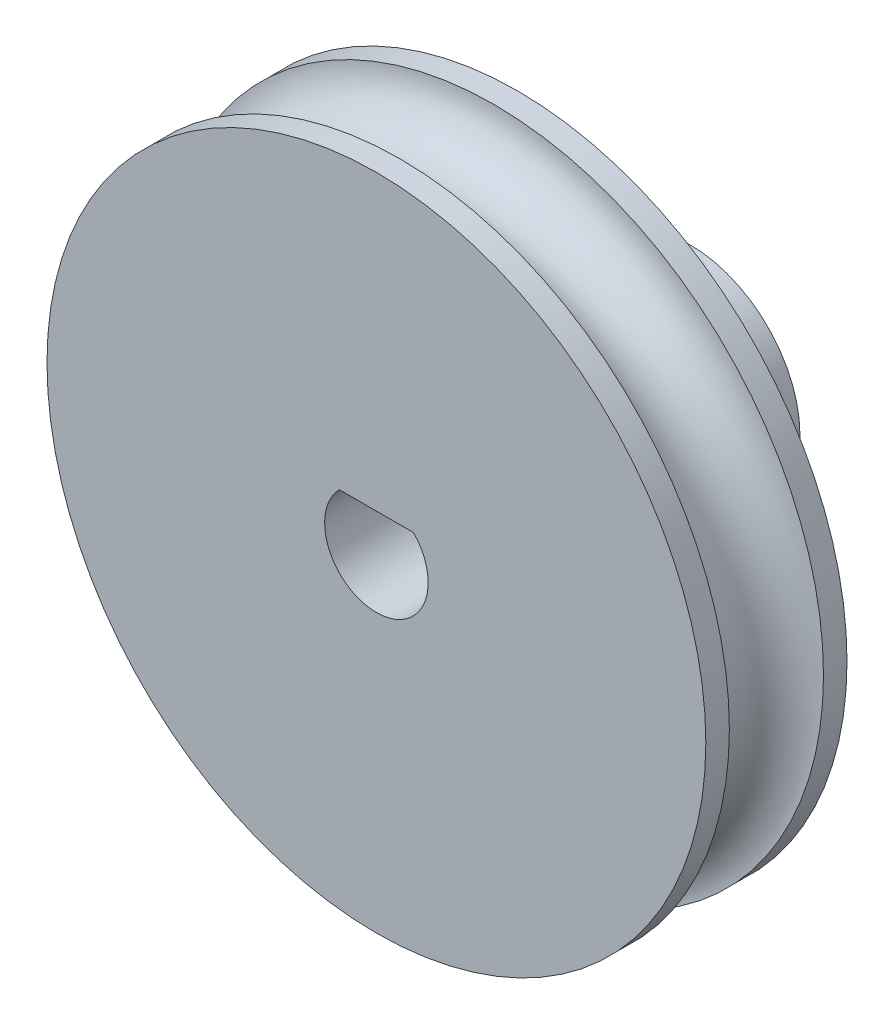
ISO-10303-21;
HEADER;
FILE_DESCRIPTION(('STEP AP214'),'2;1');
FILE_NAME('part.step','',(''),(''),'','','');
FILE_SCHEMA(('AUTOMOTIVE_DESIGN { 1 0 10303 214 1 1 1 1 }'));
ENDSEC;
DATA;
#1=APPLICATION_CONTEXT('core data for automotive mechanical design processes');
#2=APPLICATION_PROTOCOL_DEFINITION('international standard','automotive_design',2000,#1);
#3=PRODUCT_CONTEXT('',#1,'mechanical');
#4=PRODUCT('Part','Part','',(#3));
#5=PRODUCT_RELATED_PRODUCT_CATEGORY('part','',(#4));
#6=PRODUCT_DEFINITION_FORMATION('','',#4);
#7=PRODUCT_DEFINITION_CONTEXT('part definition',#1,'design');
#8=PRODUCT_DEFINITION('design','',#6,#7);
#9=PRODUCT_DEFINITION_SHAPE('','',#8);
#10=(LENGTH_UNIT() NAMED_UNIT(*) SI_UNIT(.MILLI.,.METRE.));
#11=(NAMED_UNIT(*) PLANE_ANGLE_UNIT() SI_UNIT($,.RADIAN.));
#12=(NAMED_UNIT(*) SI_UNIT($,.STERADIAN.) SOLID_ANGLE_UNIT());
#13=UNCERTAINTY_MEASURE_WITH_UNIT(LENGTH_MEASURE(1.E-05),#10,'distance_accuracy_value','');
#14=(GEOMETRIC_REPRESENTATION_CONTEXT(3) GLOBAL_UNCERTAINTY_ASSIGNED_CONTEXT((#13)) GLOBAL_UNIT_ASSIGNED_CONTEXT((#10,
#11,#12)) REPRESENTATION_CONTEXT('',''));
#15=CARTESIAN_POINT('',(0.,0.,0.));
#16=DIRECTION('',(0.,0.,1.));
#17=DIRECTION('',(1.,0.,0.));
#18=AXIS2_PLACEMENT_3D('',#15,#16,#17);
#19=CARTESIAN_POINT('',(0.,3.5,-10.));
#20=DIRECTION('',(0.,0.,1.));
#21=DIRECTION('',(1.,0.,0.));
#22=AXIS2_PLACEMENT_3D('',#19,#20,#21);
#23=PLANE('',#22);
#24=DIRECTION('',(1.,0.,0.));
#25=VECTOR('',#24,1.);
#26=CARTESIAN_POINT('',(1.18321595661992,1.15,-10.));
#27=LINE('',#26,#25);
#28=CARTESIAN_POINT('',(-1.18321595661992,1.15,-10.));
#29=VERTEX_POINT('',#28);
#30=CARTESIAN_POINT('',(1.18321595661992,1.15,-10.));
#31=VERTEX_POINT('',#30);
#32=EDGE_CURVE('E67',#29,#31,#27,.T.);
#33=ORIENTED_EDGE('',*,*,#32,.F.);
#34=CARTESIAN_POINT('',(0.,0.,-10.));
#35=DIRECTION('',(0.,0.,-1.));
#36=DIRECTION('',(-1.,0.,0.));
#37=AXIS2_PLACEMENT_3D('',#34,#35,#36);
#38=CIRCLE('',#37,1.65);
#39=EDGE_CURVE('E48',#31,#29,#38,.T.);
#40=ORIENTED_EDGE('',*,*,#39,.F.);
#41=EDGE_LOOP('',(#33,#40));
#42=FACE_BOUND('',#41,.T.);
#43=CARTESIAN_POINT('',(0.,0.,-10.));
#44=DIRECTION('',(0.,0.,1.));
#45=DIRECTION('',(1.,0.,0.));
#46=AXIS2_PLACEMENT_3D('',#43,#44,#45);
#47=CIRCLE('',#46,3.5);
#48=CARTESIAN_POINT('',(3.5,0.,-10.));
#49=VERTEX_POINT('',#48);
#50=EDGE_CURVE('E11',#49,#49,#47,.T.);
#51=ORIENTED_EDGE('',*,*,#50,.F.);
#52=EDGE_LOOP('',(#51));
#53=FACE_BOUND('',#52,.T.);
#54=ADVANCED_FACE('F34',(#42,#53),#23,.F.);
#55=CARTESIAN_POINT('',(0.,0.,0.));
#56=DIRECTION('',(0.,0.,1.));
#57=DIRECTION('',(1.,0.,0.));
#58=AXIS2_PLACEMENT_3D('',#55,#56,#57);
#59=CYLINDRICAL_SURFACE('',#58,3.5);
#60=CARTESIAN_POINT('',(0.,0.,-4.5));
#61=DIRECTION('',(0.,0.,1.));
#62=DIRECTION('',(1.,0.,0.));
#63=AXIS2_PLACEMENT_3D('',#60,#61,#62);
#64=CIRCLE('',#63,3.5);
#65=CARTESIAN_POINT('',(3.5,0.,-4.5));
#66=VERTEX_POINT('',#65);
#67=EDGE_CURVE('E41',#66,#66,#64,.T.);
#68=ORIENTED_EDGE('',*,*,#67,.F.);
#69=EDGE_LOOP('',(#68));
#70=FACE_BOUND('',#69,.T.);
#71=ORIENTED_EDGE('',*,*,#50,.T.);
#72=EDGE_LOOP('',(#71));
#73=FACE_BOUND('',#72,.T.);
#74=ADVANCED_FACE('F94',(#70,#73),#59,.T.);
#75=CARTESIAN_POINT('',(0.,10.5,-4.5));
#76=DIRECTION('',(0.,0.,1.));
#77=DIRECTION('',(1.,0.,0.));
#78=AXIS2_PLACEMENT_3D('',#75,#76,#77);
#79=PLANE('',#78);
#80=CARTESIAN_POINT('',(0.,0.,-4.5));
#81=DIRECTION('',(0.,0.,1.));
#82=DIRECTION('',(1.,0.,0.));
#83=AXIS2_PLACEMENT_3D('',#80,#81,#82);
#84=CIRCLE('',#83,10.5);
#85=CARTESIAN_POINT('',(10.5,0.,-4.5));
#86=VERTEX_POINT('',#85);
#87=EDGE_CURVE('E87',#86,#86,#84,.T.);
#88=ORIENTED_EDGE('',*,*,#87,.F.);
#89=EDGE_LOOP('',(#88));
#90=FACE_BOUND('',#89,.T.);
#91=ORIENTED_EDGE('',*,*,#67,.T.);
#92=EDGE_LOOP('',(#91));
#93=FACE_BOUND('',#92,.T.);
#94=ADVANCED_FACE('F92',(#90,#93),#79,.F.);
#95=CARTESIAN_POINT('',(0.,0.,0.));
#96=DIRECTION('',(0.,0.,1.));
#97=DIRECTION('',(1.,0.,0.));
#98=AXIS2_PLACEMENT_3D('',#95,#96,#97);
#99=CYLINDRICAL_SURFACE('',#98,10.5);
#100=CARTESIAN_POINT('',(0.,0.,-3.75));
#101=DIRECTION('',(0.,0.,1.));
#102=DIRECTION('',(1.,0.,0.));
#103=AXIS2_PLACEMENT_3D('',#100,#101,#102);
#104=CIRCLE('',#103,10.5);
#105=CARTESIAN_POINT('',(10.5,0.,-3.75));
#106=VERTEX_POINT('',#105);
#107=EDGE_CURVE('E84',#106,#106,#104,.T.);
#108=ORIENTED_EDGE('',*,*,#107,.F.);
#109=EDGE_LOOP('',(#108));
#110=FACE_BOUND('',#109,.T.);
#111=ORIENTED_EDGE('',*,*,#87,.T.);
#112=EDGE_LOOP('',(#111));
#113=FACE_BOUND('',#112,.T.);
#114=ADVANCED_FACE('F141',(#110,#113),#99,.T.);
#115=CARTESIAN_POINT('',(0.,0.,-2.25));
#116=DIRECTION('',(0.,0.,1.));
#117=DIRECTION('',(1.,0.,0.));
#118=AXIS2_PLACEMENT_3D('',#115,#116,#117);
#119=TOROIDAL_SURFACE('',#118,10.5,1.5);
#120=CARTESIAN_POINT('',(0.,0.,-0.75));
#121=DIRECTION('',(0.,0.,1.));
#122=DIRECTION('',(1.,0.,0.));
#123=AXIS2_PLACEMENT_3D('',#120,#121,#122);
#124=CIRCLE('',#123,10.5);
#125=CARTESIAN_POINT('',(10.5,0.,-0.75));
#126=VERTEX_POINT('',#125);
#127=EDGE_CURVE('E81',#126,#126,#124,.T.);
#128=ORIENTED_EDGE('',*,*,#127,.F.);
#129=EDGE_LOOP('',(#128));
#130=FACE_BOUND('',#129,.T.);
#131=ORIENTED_EDGE('',*,*,#107,.T.);
#132=EDGE_LOOP('',(#131));
#133=FACE_BOUND('',#132,.T.);
#134=ADVANCED_FACE('F137',(#130,#133),#119,.F.);
#135=CARTESIAN_POINT('',(0.,0.,0.));
#136=DIRECTION('',(0.,0.,1.));
#137=DIRECTION('',(1.,0.,0.));
#138=AXIS2_PLACEMENT_3D('',#135,#136,#137);
#139=CYLINDRICAL_SURFACE('',#138,10.5);
#140=CARTESIAN_POINT('',(0.,0.,0.));
#141=DIRECTION('',(0.,0.,1.));
#142=DIRECTION('',(1.,0.,0.));
#143=AXIS2_PLACEMENT_3D('',#140,#141,#142);
#144=CIRCLE('',#143,10.5);
#145=CARTESIAN_POINT('',(10.5,0.,0.));
#146=VERTEX_POINT('',#145);
#147=EDGE_CURVE('E78',#146,#146,#144,.T.);
#148=ORIENTED_EDGE('',*,*,#147,.F.);
#149=EDGE_LOOP('',(#148));
#150=FACE_BOUND('',#149,.T.);
#151=ORIENTED_EDGE('',*,*,#127,.T.);
#152=EDGE_LOOP('',(#151));
#153=FACE_BOUND('',#152,.T.);
#154=ADVANCED_FACE('F107',(#150,#153),#139,.T.);
#155=CARTESIAN_POINT('',(0.,0.,0.));
#156=DIRECTION('',(0.,0.,-1.));
#157=DIRECTION('',(-1.,0.,0.));
#158=AXIS2_PLACEMENT_3D('',#155,#156,#157);
#159=PLANE('',#158);
#160=DIRECTION('',(-1.,0.,0.));
#161=VECTOR('',#160,1.);
#162=CARTESIAN_POINT('',(1.18321595661992,1.15,0.));
#163=LINE('',#162,#161);
#164=CARTESIAN_POINT('',(1.18321595661992,1.15,0.));
#165=VERTEX_POINT('',#164);
#166=CARTESIAN_POINT('',(-1.18321595661992,1.15,0.));
#167=VERTEX_POINT('',#166);
#168=EDGE_CURVE('E76',#165,#167,#163,.T.);
#169=ORIENTED_EDGE('',*,*,#168,.F.);
#170=CARTESIAN_POINT('',(0.,0.,0.));
#171=DIRECTION('',(0.,0.,-1.));
#172=DIRECTION('',(-1.,0.,0.));
#173=AXIS2_PLACEMENT_3D('',#170,#171,#172);
#174=CIRCLE('',#173,1.65);
#175=EDGE_CURVE('E62',#167,#165,#174,.F.);
#176=ORIENTED_EDGE('',*,*,#175,.F.);
#177=EDGE_LOOP('',(#169,#176));
#178=FACE_BOUND('',#177,.T.);
#179=ORIENTED_EDGE('',*,*,#147,.T.);
#180=EDGE_LOOP('',(#179));
#181=FACE_BOUND('',#180,.T.);
#182=ADVANCED_FACE('F111',(#178,#181),#159,.F.);
#183=CARTESIAN_POINT('',(0.,0.,4.32781700167648));
#184=DIRECTION('',(0.,0.,-1.));
#185=DIRECTION('',(-1.,0.,0.));
#186=AXIS2_PLACEMENT_3D('',#183,#184,#185);
#187=CYLINDRICAL_SURFACE('',#186,1.65);
#188=ORIENTED_EDGE('',*,*,#175,.T.);
#189=DIRECTION('',(0.,0.,-1.));
#190=VECTOR('',#189,1.);
#191=CARTESIAN_POINT('',(1.18321595661992,1.15,4.32781700167648));
#192=LINE('',#191,#190);
#193=EDGE_CURVE('E55',#165,#31,#192,.T.);
#194=ORIENTED_EDGE('',*,*,#193,.T.);
#195=ORIENTED_EDGE('',*,*,#39,.T.);
#196=DIRECTION('',(0.,0.,-1.));
#197=VECTOR('',#196,1.);
#198=CARTESIAN_POINT('',(-1.18321595661992,1.15,4.32781700167648));
#199=LINE('',#198,#197);
#200=EDGE_CURVE('E64',#167,#29,#199,.T.);
#201=ORIENTED_EDGE('',*,*,#200,.F.);
#202=EDGE_LOOP('',(#188,#194,#195,#201));
#203=FACE_BOUND('',#202,.T.);
#204=ADVANCED_FACE('F60',(#203),#187,.F.);
#205=CARTESIAN_POINT('',(1.18321595661992,1.15,4.32781700167648));
#206=DIRECTION('',(0.,1.,0.));
#207=DIRECTION('',(0.,0.,1.));
#208=AXIS2_PLACEMENT_3D('',#205,#206,#207);
#209=PLANE('',#208);
#210=ORIENTED_EDGE('',*,*,#168,.T.);
#211=ORIENTED_EDGE('',*,*,#200,.T.);
#212=ORIENTED_EDGE('',*,*,#32,.T.);
#213=ORIENTED_EDGE('',*,*,#193,.F.);
#214=EDGE_LOOP('',(#210,#211,#212,#213));
#215=FACE_BOUND('',#214,.T.);
#216=ADVANCED_FACE('F68',(#215),#209,.F.);
#217=CLOSED_SHELL('',(#54,#74,#94,#114,#134,#154,#182,#204,#216));
#218=MANIFOLD_SOLID_BREP('B2',#217);
#219=ADVANCED_BREP_SHAPE_REPRESENTATION('',(#18,#218),#14);
#220=SHAPE_DEFINITION_REPRESENTATION(#9,#219);
ENDSEC;
END-ISO-10303-21;
